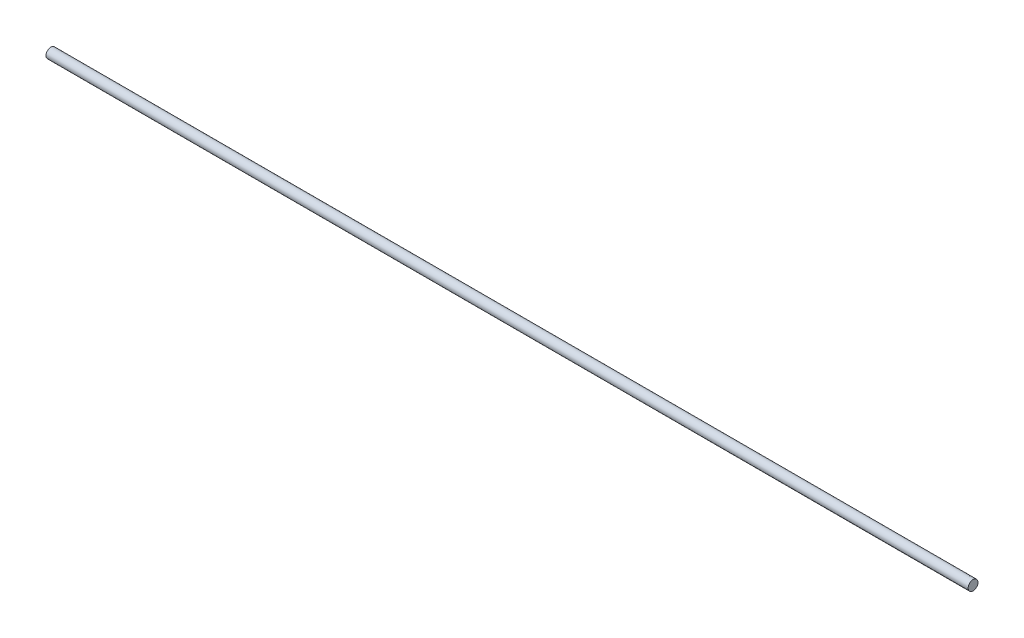
ISO-10303-21;
HEADER;
FILE_DESCRIPTION(('STEP AP214'),'2;1');
FILE_NAME('part.step','',(''),(''),'','','');
FILE_SCHEMA(('AUTOMOTIVE_DESIGN { 1 0 10303 214 1 1 1 1 }'));
ENDSEC;
DATA;
#1=APPLICATION_CONTEXT('core data for automotive mechanical design processes');
#2=APPLICATION_PROTOCOL_DEFINITION('international standard','automotive_design',2000,#1);
#3=PRODUCT_CONTEXT('',#1,'mechanical');
#4=PRODUCT('Part','Part','',(#3));
#5=PRODUCT_RELATED_PRODUCT_CATEGORY('part','',(#4));
#6=PRODUCT_DEFINITION_FORMATION('','',#4);
#7=PRODUCT_DEFINITION_CONTEXT('part definition',#1,'design');
#8=PRODUCT_DEFINITION('design','',#6,#7);
#9=PRODUCT_DEFINITION_SHAPE('','',#8);
#10=(LENGTH_UNIT() NAMED_UNIT(*) SI_UNIT(.MILLI.,.METRE.));
#11=(NAMED_UNIT(*) PLANE_ANGLE_UNIT() SI_UNIT($,.RADIAN.));
#12=(NAMED_UNIT(*) SI_UNIT($,.STERADIAN.) SOLID_ANGLE_UNIT());
#13=UNCERTAINTY_MEASURE_WITH_UNIT(LENGTH_MEASURE(1.E-05),#10,'distance_accuracy_value','');
#14=(GEOMETRIC_REPRESENTATION_CONTEXT(3) GLOBAL_UNCERTAINTY_ASSIGNED_CONTEXT((#13)) GLOBAL_UNIT_ASSIGNED_CONTEXT((#10,
#11,#12)) REPRESENTATION_CONTEXT('',''));
#15=CARTESIAN_POINT('',(0.,0.,0.));
#16=DIRECTION('',(0.,0.,1.));
#17=DIRECTION('',(1.,0.,0.));
#18=AXIS2_PLACEMENT_3D('',#15,#16,#17);
#19=CARTESIAN_POINT('',(750.,0.,0.));
#20=DIRECTION('',(-1.,0.,0.));
#21=DIRECTION('',(0.,0.,1.));
#22=AXIS2_PLACEMENT_3D('',#19,#20,#21);
#23=CYLINDRICAL_SURFACE('',#22,4.);
#24=CARTESIAN_POINT('',(750.,0.,0.));
#25=DIRECTION('',(1.,0.,0.));
#26=DIRECTION('',(0.,0.,-1.));
#27=AXIS2_PLACEMENT_3D('',#24,#25,#26);
#28=CIRCLE('',#27,4.);
#29=CARTESIAN_POINT('',(750.,0.,-4.));
#30=VERTEX_POINT('',#29);
#31=EDGE_CURVE('E10',#30,#30,#28,.T.);
#32=ORIENTED_EDGE('',*,*,#31,.F.);
#33=EDGE_LOOP('',(#32));
#34=FACE_BOUND('',#33,.T.);
#35=CARTESIAN_POINT('',(0.,0.,0.));
#36=DIRECTION('',(1.,0.,0.));
#37=DIRECTION('',(0.,0.,-1.));
#38=AXIS2_PLACEMENT_3D('',#35,#36,#37);
#39=CIRCLE('',#38,4.);
#40=CARTESIAN_POINT('',(0.,0.,-4.));
#41=VERTEX_POINT('',#40);
#42=EDGE_CURVE('E35',#41,#41,#39,.T.);
#43=ORIENTED_EDGE('',*,*,#42,.T.);
#44=EDGE_LOOP('',(#43));
#45=FACE_BOUND('',#44,.T.);
#46=ADVANCED_FACE('F32',(#34,#45),#23,.T.);
#47=CARTESIAN_POINT('',(750.,0.,0.));
#48=DIRECTION('',(1.,0.,0.));
#49=DIRECTION('',(0.,0.,-1.));
#50=AXIS2_PLACEMENT_3D('',#47,#48,#49);
#51=PLANE('',#50);
#52=ORIENTED_EDGE('',*,*,#31,.T.);
#53=EDGE_LOOP('',(#52));
#54=FACE_BOUND('',#53,.T.);
#55=ADVANCED_FACE('F47',(#54),#51,.T.);
#56=CARTESIAN_POINT('',(0.,0.,0.));
#57=DIRECTION('',(1.,0.,0.));
#58=DIRECTION('',(0.,0.,-1.));
#59=AXIS2_PLACEMENT_3D('',#56,#57,#58);
#60=PLANE('',#59);
#61=ORIENTED_EDGE('',*,*,#42,.F.);
#62=EDGE_LOOP('',(#61));
#63=FACE_BOUND('',#62,.T.);
#64=ADVANCED_FACE('F45',(#63),#60,.F.);
#65=CLOSED_SHELL('',(#46,#55,#64));
#66=MANIFOLD_SOLID_BREP('B2',#65);
#67=ADVANCED_BREP_SHAPE_REPRESENTATION('',(#18,#66),#14);
#68=SHAPE_DEFINITION_REPRESENTATION(#9,#67);
ENDSEC;
END-ISO-10303-21;
